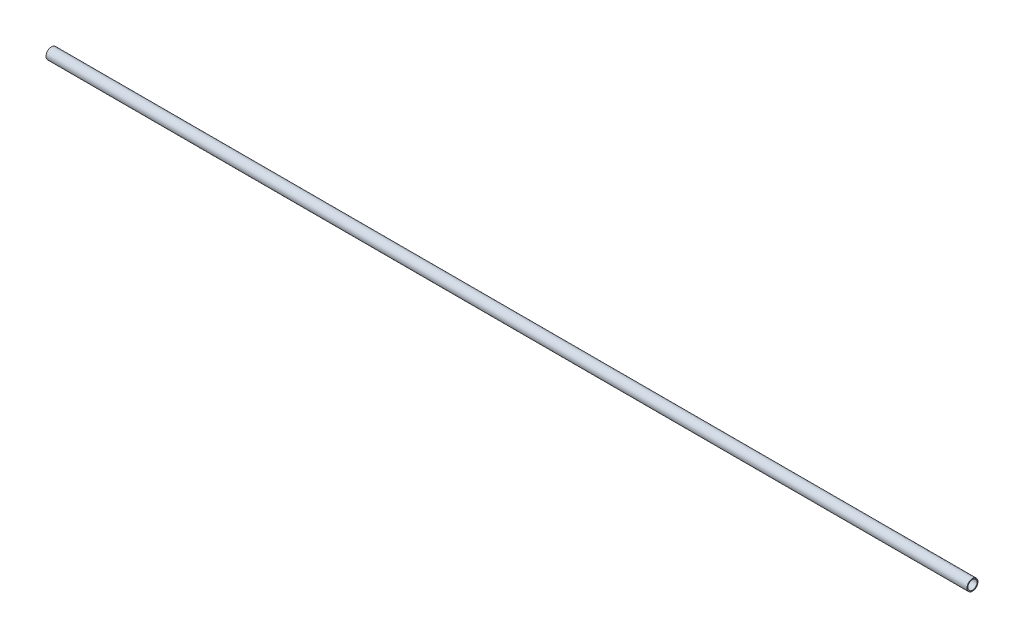
ISO-10303-21;
HEADER;
FILE_DESCRIPTION(('STEP AP214'),'2;1');
FILE_NAME('part.step','',(''),(''),'','','');
FILE_SCHEMA(('AUTOMOTIVE_DESIGN { 1 0 10303 214 1 1 1 1 }'));
ENDSEC;
DATA;
#1=APPLICATION_CONTEXT('core data for automotive mechanical design processes');
#2=APPLICATION_PROTOCOL_DEFINITION('international standard','automotive_design',2000,#1);
#3=PRODUCT_CONTEXT('',#1,'mechanical');
#4=PRODUCT('Part','Part','',(#3));
#5=PRODUCT_RELATED_PRODUCT_CATEGORY('part','',(#4));
#6=PRODUCT_DEFINITION_FORMATION('','',#4);
#7=PRODUCT_DEFINITION_CONTEXT('part definition',#1,'design');
#8=PRODUCT_DEFINITION('design','',#6,#7);
#9=PRODUCT_DEFINITION_SHAPE('','',#8);
#10=(LENGTH_UNIT() NAMED_UNIT(*) SI_UNIT(.MILLI.,.METRE.));
#11=(NAMED_UNIT(*) PLANE_ANGLE_UNIT() SI_UNIT($,.RADIAN.));
#12=(NAMED_UNIT(*) SI_UNIT($,.STERADIAN.) SOLID_ANGLE_UNIT());
#13=UNCERTAINTY_MEASURE_WITH_UNIT(LENGTH_MEASURE(1.E-05),#10,'distance_accuracy_value','');
#14=(GEOMETRIC_REPRESENTATION_CONTEXT(3) GLOBAL_UNCERTAINTY_ASSIGNED_CONTEXT((#13)) GLOBAL_UNIT_ASSIGNED_CONTEXT((#10,
#11,#12)) REPRESENTATION_CONTEXT('',''));
#15=CARTESIAN_POINT('',(0.,0.,0.));
#16=DIRECTION('',(0.,0.,1.));
#17=DIRECTION('',(1.,0.,0.));
#18=AXIS2_PLACEMENT_3D('',#15,#16,#17);
#19=CARTESIAN_POINT('',(500.,0.,0.));
#20=DIRECTION('',(1.,0.,0.));
#21=DIRECTION('',(0.,0.,-1.));
#22=AXIS2_PLACEMENT_3D('',#19,#20,#21);
#23=PLANE('',#22);
#24=CARTESIAN_POINT('',(500.,0.,0.));
#25=DIRECTION('',(1.,0.,0.));
#26=DIRECTION('',(0.,0.,-1.));
#27=AXIS2_PLACEMENT_3D('',#24,#25,#26);
#28=CIRCLE('',#27,3.);
#29=CARTESIAN_POINT('',(500.,0.,-3.));
#30=VERTEX_POINT('',#29);
#31=EDGE_CURVE('E10',#30,#30,#28,.T.);
#32=ORIENTED_EDGE('',*,*,#31,.T.);
#33=EDGE_LOOP('',(#32));
#34=FACE_BOUND('',#33,.T.);
#35=CARTESIAN_POINT('',(500.,0.,0.));
#36=DIRECTION('',(1.,0.,0.));
#37=DIRECTION('',(0.,0.,-1.));
#38=AXIS2_PLACEMENT_3D('',#35,#36,#37);
#39=CIRCLE('',#38,2.5);
#40=CARTESIAN_POINT('',(500.,0.,-2.5));
#41=VERTEX_POINT('',#40);
#42=EDGE_CURVE('E54',#41,#41,#39,.T.);
#43=ORIENTED_EDGE('',*,*,#42,.F.);
#44=EDGE_LOOP('',(#43));
#45=FACE_BOUND('',#44,.T.);
#46=ADVANCED_FACE('F41',(#34,#45),#23,.T.);
#47=CARTESIAN_POINT('',(0.,0.,0.));
#48=DIRECTION('',(1.,0.,0.));
#49=DIRECTION('',(0.,0.,-1.));
#50=AXIS2_PLACEMENT_3D('',#47,#48,#49);
#51=PLANE('',#50);
#52=CARTESIAN_POINT('',(0.,0.,0.));
#53=DIRECTION('',(1.,0.,0.));
#54=DIRECTION('',(0.,0.,-1.));
#55=AXIS2_PLACEMENT_3D('',#52,#53,#54);
#56=CIRCLE('',#55,3.);
#57=CARTESIAN_POINT('',(0.,0.,-3.));
#58=VERTEX_POINT('',#57);
#59=EDGE_CURVE('E45',#58,#58,#56,.T.);
#60=ORIENTED_EDGE('',*,*,#59,.F.);
#61=EDGE_LOOP('',(#60));
#62=FACE_BOUND('',#61,.T.);
#63=CARTESIAN_POINT('',(0.,0.,0.));
#64=DIRECTION('',(1.,0.,0.));
#65=DIRECTION('',(0.,0.,-1.));
#66=AXIS2_PLACEMENT_3D('',#63,#64,#65);
#67=CIRCLE('',#66,2.5);
#68=CARTESIAN_POINT('',(0.,0.,-2.5));
#69=VERTEX_POINT('',#68);
#70=EDGE_CURVE('E56',#69,#69,#67,.T.);
#71=ORIENTED_EDGE('',*,*,#70,.T.);
#72=EDGE_LOOP('',(#71));
#73=FACE_BOUND('',#72,.T.);
#74=ADVANCED_FACE('F68',(#62,#73),#51,.F.);
#75=CARTESIAN_POINT('',(500.,0.,0.));
#76=DIRECTION('',(-1.,0.,0.));
#77=DIRECTION('',(0.,0.,1.));
#78=AXIS2_PLACEMENT_3D('',#75,#76,#77);
#79=CYLINDRICAL_SURFACE('',#78,3.);
#80=ORIENTED_EDGE('',*,*,#31,.F.);
#81=EDGE_LOOP('',(#80));
#82=FACE_BOUND('',#81,.T.);
#83=ORIENTED_EDGE('',*,*,#59,.T.);
#84=EDGE_LOOP('',(#83));
#85=FACE_BOUND('',#84,.T.);
#86=ADVANCED_FACE('F43',(#82,#85),#79,.T.);
#87=CARTESIAN_POINT('',(500.,0.,0.));
#88=DIRECTION('',(-1.,0.,0.));
#89=DIRECTION('',(0.,0.,1.));
#90=AXIS2_PLACEMENT_3D('',#87,#88,#89);
#91=CYLINDRICAL_SURFACE('',#90,2.5);
#92=ORIENTED_EDGE('',*,*,#42,.T.);
#93=EDGE_LOOP('',(#92));
#94=FACE_BOUND('',#93,.T.);
#95=ORIENTED_EDGE('',*,*,#70,.F.);
#96=EDGE_LOOP('',(#95));
#97=FACE_BOUND('',#96,.T.);
#98=ADVANCED_FACE('F64',(#94,#97),#91,.F.);
#99=CLOSED_SHELL('',(#46,#74,#86,#98));
#100=MANIFOLD_SOLID_BREP('B2',#99);
#101=ADVANCED_BREP_SHAPE_REPRESENTATION('',(#18,#100),#14);
#102=SHAPE_DEFINITION_REPRESENTATION(#9,#101);
ENDSEC;
END-ISO-10303-21;
